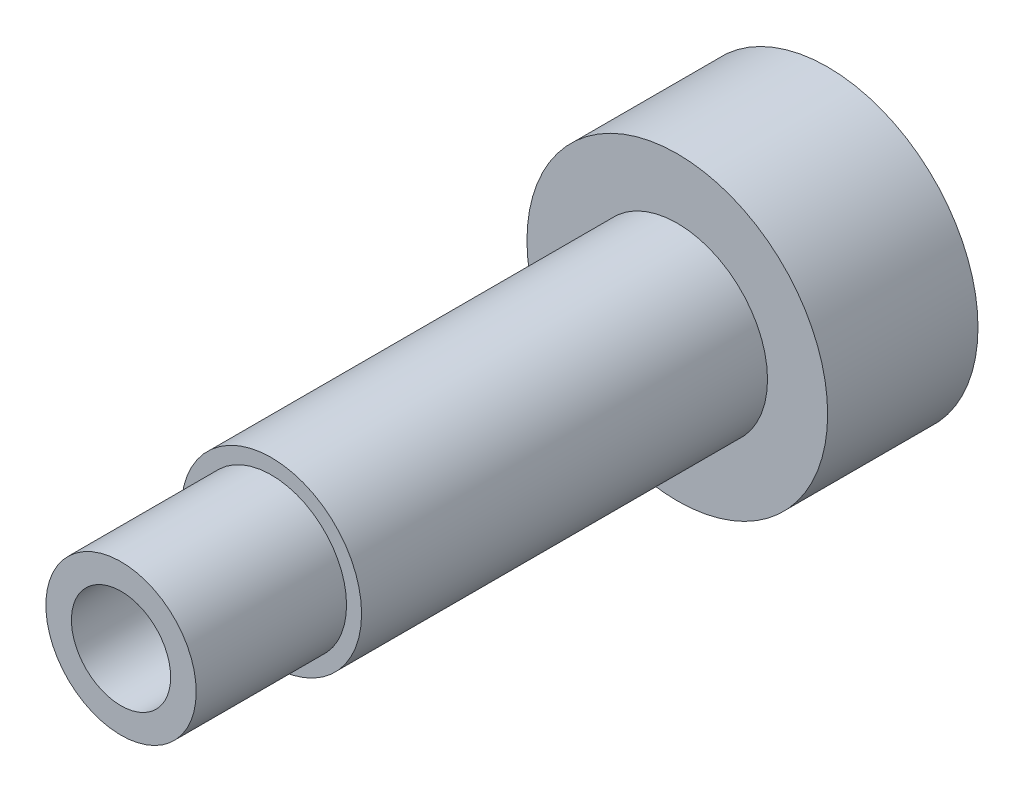
ISO-10303-21;
HEADER;
FILE_DESCRIPTION(('STEP AP214'),'2;1');
FILE_NAME('part.step','',(''),(''),'','','');
FILE_SCHEMA(('AUTOMOTIVE_DESIGN { 1 0 10303 214 1 1 1 1 }'));
ENDSEC;
DATA;
#1=APPLICATION_CONTEXT('core data for automotive mechanical design processes');
#2=APPLICATION_PROTOCOL_DEFINITION('international standard','automotive_design',2000,#1);
#3=PRODUCT_CONTEXT('',#1,'mechanical');
#4=PRODUCT('Part','Part','',(#3));
#5=PRODUCT_RELATED_PRODUCT_CATEGORY('part','',(#4));
#6=PRODUCT_DEFINITION_FORMATION('','',#4);
#7=PRODUCT_DEFINITION_CONTEXT('part definition',#1,'design');
#8=PRODUCT_DEFINITION('design','',#6,#7);
#9=PRODUCT_DEFINITION_SHAPE('','',#8);
#10=(LENGTH_UNIT() NAMED_UNIT(*) SI_UNIT(.MILLI.,.METRE.));
#11=(NAMED_UNIT(*) PLANE_ANGLE_UNIT() SI_UNIT($,.RADIAN.));
#12=(NAMED_UNIT(*) SI_UNIT($,.STERADIAN.) SOLID_ANGLE_UNIT());
#13=UNCERTAINTY_MEASURE_WITH_UNIT(LENGTH_MEASURE(1.E-05),#10,'distance_accuracy_value','');
#14=(GEOMETRIC_REPRESENTATION_CONTEXT(3) GLOBAL_UNCERTAINTY_ASSIGNED_CONTEXT((#13)) GLOBAL_UNIT_ASSIGNED_CONTEXT((#10,
#11,#12)) REPRESENTATION_CONTEXT('',''));
#15=CARTESIAN_POINT('',(0.,0.,0.));
#16=DIRECTION('',(0.,0.,1.));
#17=DIRECTION('',(1.,0.,0.));
#18=AXIS2_PLACEMENT_3D('',#15,#16,#17);
#19=CARTESIAN_POINT('',(0.,0.,13.5));
#20=DIRECTION('',(0.,0.,1.));
#21=DIRECTION('',(1.,0.,0.));
#22=AXIS2_PLACEMENT_3D('',#19,#20,#21);
#23=PLANE('',#22);
#24=CARTESIAN_POINT('',(0.,0.,13.5));
#25=DIRECTION('',(0.,0.,1.));
#26=DIRECTION('',(1.,0.,0.));
#27=AXIS2_PLACEMENT_3D('',#24,#25,#26);
#28=CIRCLE('',#27,3.);
#29=CARTESIAN_POINT('',(3.,0.,13.5));
#30=VERTEX_POINT('',#29);
#31=EDGE_CURVE('E11',#30,#30,#28,.T.);
#32=ORIENTED_EDGE('',*,*,#31,.T.);
#33=EDGE_LOOP('',(#32));
#34=FACE_BOUND('',#33,.T.);
#35=CARTESIAN_POINT('',(0.,0.,13.5));
#36=DIRECTION('',(0.,0.,1.));
#37=DIRECTION('',(1.,0.,0.));
#38=AXIS2_PLACEMENT_3D('',#35,#36,#37);
#39=CIRCLE('',#38,2.5);
#40=CARTESIAN_POINT('',(2.5,0.,13.5));
#41=VERTEX_POINT('',#40);
#42=EDGE_CURVE('E66',#41,#41,#39,.T.);
#43=ORIENTED_EDGE('',*,*,#42,.F.);
#44=EDGE_LOOP('',(#43));
#45=FACE_BOUND('',#44,.T.);
#46=ADVANCED_FACE('F33',(#34,#45),#23,.T.);
#47=CARTESIAN_POINT('',(0.,0.,13.5));
#48=DIRECTION('',(0.,0.,-1.));
#49=DIRECTION('',(-1.,0.,0.));
#50=AXIS2_PLACEMENT_3D('',#47,#48,#49);
#51=CYLINDRICAL_SURFACE('',#50,3.);
#52=ORIENTED_EDGE('',*,*,#31,.F.);
#53=EDGE_LOOP('',(#52));
#54=FACE_BOUND('',#53,.T.);
#55=CARTESIAN_POINT('',(0.,0.,0.));
#56=DIRECTION('',(0.,0.,-1.));
#57=DIRECTION('',(-1.,0.,0.));
#58=AXIS2_PLACEMENT_3D('',#55,#56,#57);
#59=CIRCLE('',#58,3.);
#60=CARTESIAN_POINT('',(-3.,0.,0.));
#61=VERTEX_POINT('',#60);
#62=EDGE_CURVE('E61',#61,#61,#59,.T.);
#63=ORIENTED_EDGE('',*,*,#62,.F.);
#64=EDGE_LOOP('',(#63));
#65=FACE_BOUND('',#64,.T.);
#66=ADVANCED_FACE('F35',(#54,#65),#51,.T.);
#67=CARTESIAN_POINT('',(0.,0.,18.5));
#68=DIRECTION('',(0.,0.,-1.));
#69=DIRECTION('',(-1.,0.,0.));
#70=AXIS2_PLACEMENT_3D('',#67,#68,#69);
#71=CYLINDRICAL_SURFACE('',#70,2.5);
#72=CARTESIAN_POINT('',(0.,0.,18.5));
#73=DIRECTION('',(0.,0.,1.));
#74=DIRECTION('',(1.,0.,0.));
#75=AXIS2_PLACEMENT_3D('',#72,#73,#74);
#76=CIRCLE('',#75,2.5);
#77=CARTESIAN_POINT('',(2.5,0.,18.5));
#78=VERTEX_POINT('',#77);
#79=EDGE_CURVE('E40',#78,#78,#76,.T.);
#80=ORIENTED_EDGE('',*,*,#79,.F.);
#81=EDGE_LOOP('',(#80));
#82=FACE_BOUND('',#81,.T.);
#83=ORIENTED_EDGE('',*,*,#42,.T.);
#84=EDGE_LOOP('',(#83));
#85=FACE_BOUND('',#84,.T.);
#86=ADVANCED_FACE('F71',(#82,#85),#71,.T.);
#87=CARTESIAN_POINT('',(0.,0.,18.5));
#88=DIRECTION('',(0.,0.,1.));
#89=DIRECTION('',(1.,0.,0.));
#90=AXIS2_PLACEMENT_3D('',#87,#88,#89);
#91=PLANE('',#90);
#92=CARTESIAN_POINT('',(0.,0.,18.5));
#93=DIRECTION('',(0.,0.,1.));
#94=DIRECTION('',(1.,0.,0.));
#95=AXIS2_PLACEMENT_3D('',#92,#93,#94);
#96=CIRCLE('',#95,1.65);
#97=CARTESIAN_POINT('',(1.65,0.,18.5));
#98=VERTEX_POINT('',#97);
#99=EDGE_CURVE('E52',#98,#98,#96,.T.);
#100=ORIENTED_EDGE('',*,*,#99,.F.);
#101=EDGE_LOOP('',(#100));
#102=FACE_BOUND('',#101,.T.);
#103=ORIENTED_EDGE('',*,*,#79,.T.);
#104=EDGE_LOOP('',(#103));
#105=FACE_BOUND('',#104,.T.);
#106=ADVANCED_FACE('F82',(#102,#105),#91,.T.);
#107=CARTESIAN_POINT('',(0.,0.,0.));
#108=DIRECTION('',(0.,0.,-1.));
#109=DIRECTION('',(-1.,0.,0.));
#110=AXIS2_PLACEMENT_3D('',#107,#108,#109);
#111=PLANE('',#110);
#112=CARTESIAN_POINT('',(0.,0.,0.));
#113=DIRECTION('',(0.,0.,-1.));
#114=DIRECTION('',(-1.,0.,0.));
#115=AXIS2_PLACEMENT_3D('',#112,#113,#114);
#116=CIRCLE('',#115,5.);
#117=CARTESIAN_POINT('',(-5.,0.,0.));
#118=VERTEX_POINT('',#117);
#119=EDGE_CURVE('E55',#118,#118,#116,.T.);
#120=ORIENTED_EDGE('',*,*,#119,.F.);
#121=EDGE_LOOP('',(#120));
#122=FACE_BOUND('',#121,.T.);
#123=ORIENTED_EDGE('',*,*,#62,.T.);
#124=EDGE_LOOP('',(#123));
#125=FACE_BOUND('',#124,.T.);
#126=ADVANCED_FACE('F86',(#122,#125),#111,.F.);
#127=CARTESIAN_POINT('',(0.,0.,-5.));
#128=DIRECTION('',(0.,0.,1.));
#129=DIRECTION('',(1.,0.,0.));
#130=AXIS2_PLACEMENT_3D('',#127,#128,#129);
#131=CYLINDRICAL_SURFACE('',#130,5.);
#132=CARTESIAN_POINT('',(0.,0.,-5.));
#133=DIRECTION('',(0.,0.,-1.));
#134=DIRECTION('',(-1.,0.,0.));
#135=AXIS2_PLACEMENT_3D('',#132,#133,#134);
#136=CIRCLE('',#135,5.);
#137=CARTESIAN_POINT('',(-5.,0.,-5.));
#138=VERTEX_POINT('',#137);
#139=EDGE_CURVE('E58',#138,#138,#136,.T.);
#140=ORIENTED_EDGE('',*,*,#139,.F.);
#141=EDGE_LOOP('',(#140));
#142=FACE_BOUND('',#141,.T.);
#143=ORIENTED_EDGE('',*,*,#119,.T.);
#144=EDGE_LOOP('',(#143));
#145=FACE_BOUND('',#144,.T.);
#146=ADVANCED_FACE('F88',(#142,#145),#131,.T.);
#147=CARTESIAN_POINT('',(0.,0.,-5.));
#148=DIRECTION('',(0.,0.,-1.));
#149=DIRECTION('',(-1.,0.,0.));
#150=AXIS2_PLACEMENT_3D('',#147,#148,#149);
#151=PLANE('',#150);
#152=ORIENTED_EDGE('',*,*,#139,.T.);
#153=EDGE_LOOP('',(#152));
#154=FACE_BOUND('',#153,.T.);
#155=ADVANCED_FACE('F91',(#154),#151,.T.);
#156=CARTESIAN_POINT('',(0.,0.,18.5));
#157=DIRECTION('',(0.,0.,1.));
#158=DIRECTION('',(1.,0.,0.));
#159=AXIS2_PLACEMENT_3D('',#156,#157,#158);
#160=CYLINDRICAL_SURFACE('',#159,1.65);
#161=CARTESIAN_POINT('',(0.,0.,8.4));
#162=DIRECTION('',(0.,0.,1.));
#163=DIRECTION('',(1.,0.,0.));
#164=AXIS2_PLACEMENT_3D('',#161,#162,#163);
#165=CIRCLE('',#164,1.65);
#166=CARTESIAN_POINT('',(1.65,0.,8.4));
#167=VERTEX_POINT('',#166);
#168=EDGE_CURVE('E50',#167,#167,#165,.T.);
#169=ORIENTED_EDGE('',*,*,#168,.F.);
#170=EDGE_LOOP('',(#169));
#171=FACE_BOUND('',#170,.T.);
#172=ORIENTED_EDGE('',*,*,#99,.T.);
#173=EDGE_LOOP('',(#172));
#174=FACE_BOUND('',#173,.T.);
#175=ADVANCED_FACE('F46',(#171,#174),#160,.F.);
#176=CARTESIAN_POINT('',(0.,0.,8.4));
#177=DIRECTION('',(0.,0.,1.));
#178=DIRECTION('',(1.,0.,0.));
#179=AXIS2_PLACEMENT_3D('',#176,#177,#178);
#180=CONICAL_SURFACE('',#179,1.65,1.02974425867665);
#181=CARTESIAN_POINT('',(0.,0.,7.40857997860452));
#182=VERTEX_POINT('',#181);
#183=VERTEX_LOOP('',#182);
#184=FACE_BOUND('',#183,.T.);
#185=ORIENTED_EDGE('',*,*,#168,.T.);
#186=EDGE_LOOP('',(#185));
#187=FACE_BOUND('',#186,.T.);
#188=ADVANCED_FACE('F43',(#184,#187),#180,.F.);
#189=CLOSED_SHELL('',(#46,#66,#86,#106,#126,#146,#155,#175,#188));
#190=MANIFOLD_SOLID_BREP('B2',#189);
#191=ADVANCED_BREP_SHAPE_REPRESENTATION('',(#18,#190),#14);
#192=SHAPE_DEFINITION_REPRESENTATION(#9,#191);
ENDSEC;
END-ISO-10303-21;
